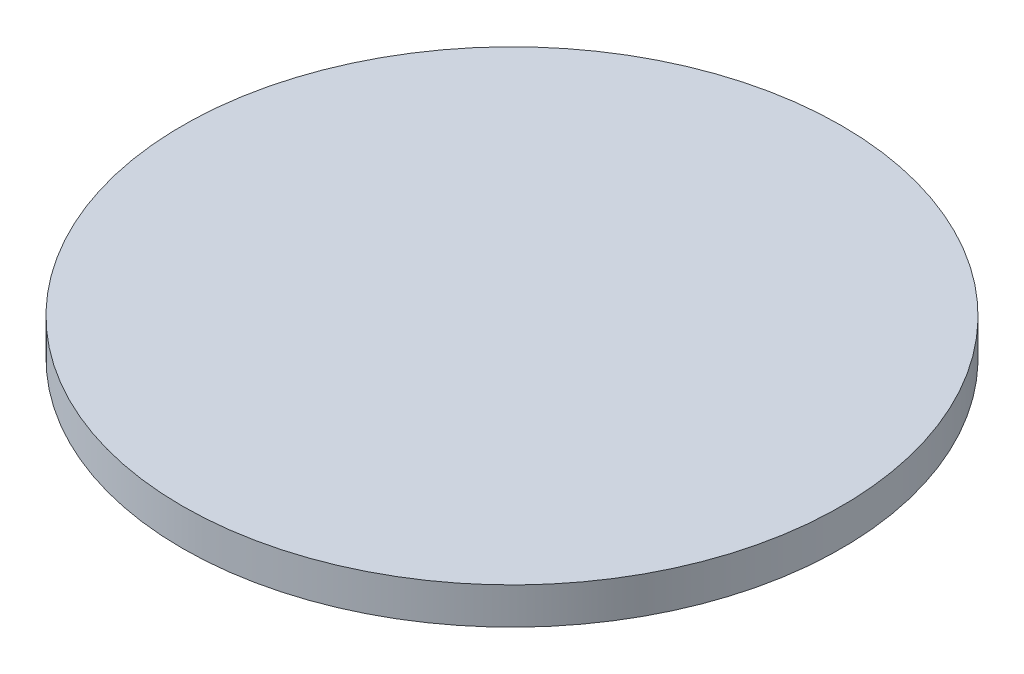
ISO-10303-21;
HEADER;
FILE_DESCRIPTION(('STEP AP214'),'2;1');
FILE_NAME('part.step','',(''),(''),'','','');
FILE_SCHEMA(('AUTOMOTIVE_DESIGN { 1 0 10303 214 1 1 1 1 }'));
ENDSEC;
DATA;
#1=APPLICATION_CONTEXT('core data for automotive mechanical design processes');
#2=APPLICATION_PROTOCOL_DEFINITION('international standard','automotive_design',2000,#1);
#3=PRODUCT_CONTEXT('',#1,'mechanical');
#4=PRODUCT('Part','Part','',(#3));
#5=PRODUCT_RELATED_PRODUCT_CATEGORY('part','',(#4));
#6=PRODUCT_DEFINITION_FORMATION('','',#4);
#7=PRODUCT_DEFINITION_CONTEXT('part definition',#1,'design');
#8=PRODUCT_DEFINITION('design','',#6,#7);
#9=PRODUCT_DEFINITION_SHAPE('','',#8);
#10=(LENGTH_UNIT() NAMED_UNIT(*) SI_UNIT(.MILLI.,.METRE.));
#11=(NAMED_UNIT(*) PLANE_ANGLE_UNIT() SI_UNIT($,.RADIAN.));
#12=(NAMED_UNIT(*) SI_UNIT($,.STERADIAN.) SOLID_ANGLE_UNIT());
#13=UNCERTAINTY_MEASURE_WITH_UNIT(LENGTH_MEASURE(1.E-05),#10,'distance_accuracy_value','');
#14=(GEOMETRIC_REPRESENTATION_CONTEXT(3) GLOBAL_UNCERTAINTY_ASSIGNED_CONTEXT((#13)) GLOBAL_UNIT_ASSIGNED_CONTEXT((#10,
#11,#12)) REPRESENTATION_CONTEXT('',''));
#15=CARTESIAN_POINT('',(0.,0.,0.));
#16=DIRECTION('',(0.,0.,1.));
#17=DIRECTION('',(1.,0.,0.));
#18=AXIS2_PLACEMENT_3D('',#15,#16,#17);
#19=CARTESIAN_POINT('',(0.,3.,0.));
#20=DIRECTION('',(0.,-1.,0.));
#21=DIRECTION('',(0.,0.,-1.));
#22=AXIS2_PLACEMENT_3D('',#19,#20,#21);
#23=CYLINDRICAL_SURFACE('',#22,27.);
#24=CARTESIAN_POINT('',(0.,3.,0.));
#25=DIRECTION('',(0.,1.,0.));
#26=DIRECTION('',(0.,0.,1.));
#27=AXIS2_PLACEMENT_3D('',#24,#25,#26);
#28=CIRCLE('',#27,27.);
#29=CARTESIAN_POINT('',(0.,3.,27.));
#30=VERTEX_POINT('',#29);
#31=EDGE_CURVE('E10',#30,#30,#28,.T.);
#32=ORIENTED_EDGE('',*,*,#31,.F.);
#33=EDGE_LOOP('',(#32));
#34=FACE_BOUND('',#33,.T.);
#35=CARTESIAN_POINT('',(0.,0.,0.));
#36=DIRECTION('',(0.,1.,0.));
#37=DIRECTION('',(0.,0.,1.));
#38=AXIS2_PLACEMENT_3D('',#35,#36,#37);
#39=CIRCLE('',#38,27.);
#40=CARTESIAN_POINT('',(0.,0.,27.));
#41=VERTEX_POINT('',#40);
#42=EDGE_CURVE('E35',#41,#41,#39,.T.);
#43=ORIENTED_EDGE('',*,*,#42,.T.);
#44=EDGE_LOOP('',(#43));
#45=FACE_BOUND('',#44,.T.);
#46=ADVANCED_FACE('F32',(#34,#45),#23,.T.);
#47=CARTESIAN_POINT('',(0.,3.,0.));
#48=DIRECTION('',(0.,1.,0.));
#49=DIRECTION('',(0.,0.,1.));
#50=AXIS2_PLACEMENT_3D('',#47,#48,#49);
#51=PLANE('',#50);
#52=ORIENTED_EDGE('',*,*,#31,.T.);
#53=EDGE_LOOP('',(#52));
#54=FACE_BOUND('',#53,.T.);
#55=ADVANCED_FACE('F47',(#54),#51,.T.);
#56=CARTESIAN_POINT('',(0.,0.,0.));
#57=DIRECTION('',(0.,1.,0.));
#58=DIRECTION('',(0.,0.,1.));
#59=AXIS2_PLACEMENT_3D('',#56,#57,#58);
#60=PLANE('',#59);
#61=ORIENTED_EDGE('',*,*,#42,.F.);
#62=EDGE_LOOP('',(#61));
#63=FACE_BOUND('',#62,.T.);
#64=ADVANCED_FACE('F45',(#63),#60,.F.);
#65=CLOSED_SHELL('',(#46,#55,#64));
#66=MANIFOLD_SOLID_BREP('B2',#65);
#67=ADVANCED_BREP_SHAPE_REPRESENTATION('',(#18,#66),#14);
#68=SHAPE_DEFINITION_REPRESENTATION(#9,#67);
ENDSEC;
END-ISO-10303-21;
